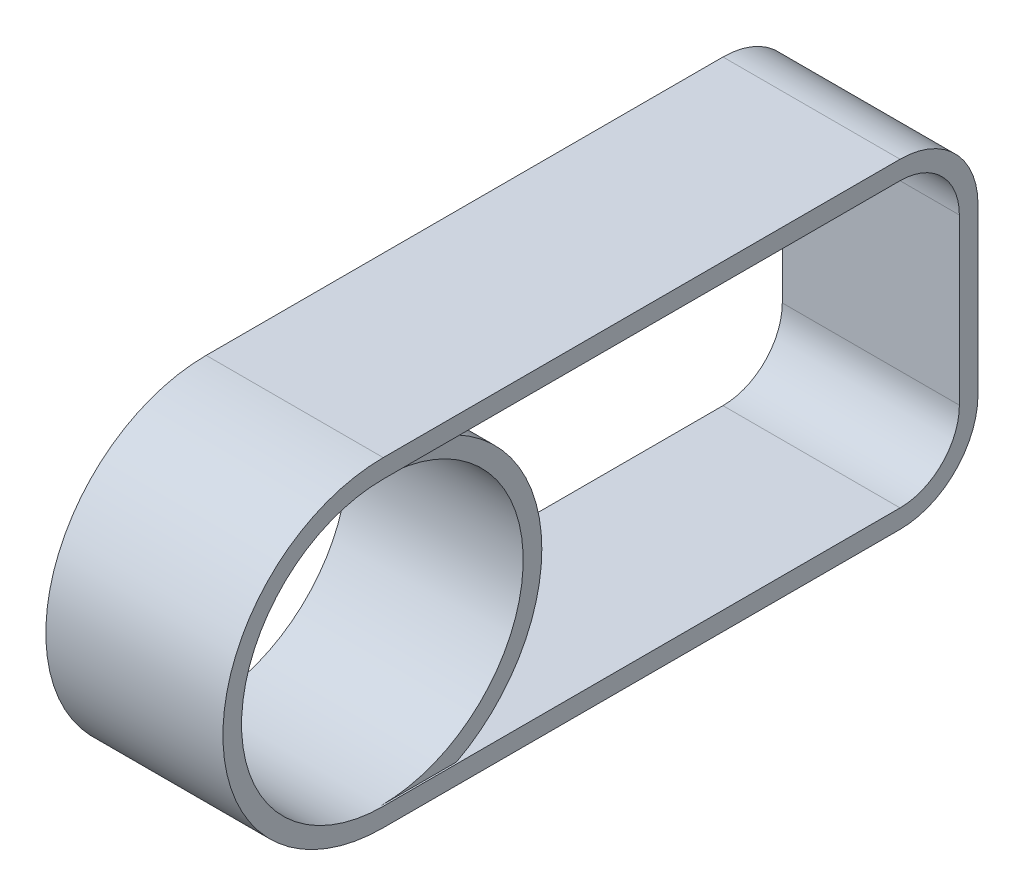
ISO-10303-21;
HEADER;
FILE_DESCRIPTION(('STEP AP214'),'2;1');
FILE_NAME('part.step','',(''),(''),'','','');
FILE_SCHEMA(('AUTOMOTIVE_DESIGN { 1 0 10303 214 1 1 1 1 }'));
ENDSEC;
DATA;
#1=APPLICATION_CONTEXT('core data for automotive mechanical design processes');
#2=APPLICATION_PROTOCOL_DEFINITION('international standard','automotive_design',2000,#1);
#3=PRODUCT_CONTEXT('',#1,'mechanical');
#4=PRODUCT('Part','Part','',(#3));
#5=PRODUCT_RELATED_PRODUCT_CATEGORY('part','',(#4));
#6=PRODUCT_DEFINITION_FORMATION('','',#4);
#7=PRODUCT_DEFINITION_CONTEXT('part definition',#1,'design');
#8=PRODUCT_DEFINITION('design','',#6,#7);
#9=PRODUCT_DEFINITION_SHAPE('','',#8);
#10=(LENGTH_UNIT() NAMED_UNIT(*) SI_UNIT(.MILLI.,.METRE.));
#11=(NAMED_UNIT(*) PLANE_ANGLE_UNIT() SI_UNIT($,.RADIAN.));
#12=(NAMED_UNIT(*) SI_UNIT($,.STERADIAN.) SOLID_ANGLE_UNIT());
#13=UNCERTAINTY_MEASURE_WITH_UNIT(LENGTH_MEASURE(1.E-05),#10,'distance_accuracy_value','');
#14=(GEOMETRIC_REPRESENTATION_CONTEXT(3) GLOBAL_UNCERTAINTY_ASSIGNED_CONTEXT((#13)) GLOBAL_UNIT_ASSIGNED_CONTEXT((#10,
#11,#12)) REPRESENTATION_CONTEXT('',''));
#15=CARTESIAN_POINT('',(0.,0.,0.));
#16=DIRECTION('',(0.,0.,1.));
#17=DIRECTION('',(1.,0.,0.));
#18=AXIS2_PLACEMENT_3D('',#15,#16,#17);
#19=CARTESIAN_POINT('',(1045.,836.,0.));
#20=DIRECTION('',(1.,0.,0.));
#21=DIRECTION('',(0.,0.,-1.));
#22=AXIS2_PLACEMENT_3D('',#19,#20,#21);
#23=PLANE('',#22);
#24=CARTESIAN_POINT('',(1045.,836.,0.));
#25=DIRECTION('',(1.,0.,0.));
#26=DIRECTION('',(0.,0.,-1.));
#27=AXIS2_PLACEMENT_3D('',#24,#25,#26);
#28=CIRCLE('',#27,836.);
#29=CARTESIAN_POINT('',(1045.,1672.,0.));
#30=VERTEX_POINT('',#29);
#31=CARTESIAN_POINT('',(1045.,0.,0.));
#32=VERTEX_POINT('',#31);
#33=EDGE_CURVE('E154',#30,#32,#28,.T.);
#34=ORIENTED_EDGE('',*,*,#33,.F.);
#35=DIRECTION('',(0.,0.,1.));
#36=VECTOR('',#35,1.);
#37=CARTESIAN_POINT('',(1045.,1672.,-3050.));
#38=LINE('',#37,#36);
#39=CARTESIAN_POINT('',(1045.,1672.,-3050.));
#40=VERTEX_POINT('',#39);
#41=EDGE_CURVE('E175',#40,#30,#38,.T.);
#42=ORIENTED_EDGE('',*,*,#41,.F.);
#43=CARTESIAN_POINT('',(1045.,1322.,-3050.));
#44=DIRECTION('',(1.,0.,0.));
#45=DIRECTION('',(0.,0.,-1.));
#46=AXIS2_PLACEMENT_3D('',#43,#44,#45);
#47=CIRCLE('',#46,350.);
#48=CARTESIAN_POINT('',(1045.,1322.,-3400.));
#49=VERTEX_POINT('',#48);
#50=EDGE_CURVE('E173',#49,#40,#47,.T.);
#51=ORIENTED_EDGE('',*,*,#50,.F.);
#52=DIRECTION('',(0.,1.,0.));
#53=VECTOR('',#52,1.);
#54=CARTESIAN_POINT('',(1045.,350.,-3400.));
#55=LINE('',#54,#53);
#56=CARTESIAN_POINT('',(1045.,350.,-3400.));
#57=VERTEX_POINT('',#56);
#58=EDGE_CURVE('E171',#57,#49,#55,.T.);
#59=ORIENTED_EDGE('',*,*,#58,.F.);
#60=CARTESIAN_POINT('',(1045.,350.,-3050.));
#61=DIRECTION('',(1.,0.,0.));
#62=DIRECTION('',(0.,0.,-1.));
#63=AXIS2_PLACEMENT_3D('',#60,#61,#62);
#64=CIRCLE('',#63,350.);
#65=CARTESIAN_POINT('',(1045.,0.,-3050.));
#66=VERTEX_POINT('',#65);
#67=EDGE_CURVE('E168',#66,#57,#64,.T.);
#68=ORIENTED_EDGE('',*,*,#67,.F.);
#69=DIRECTION('',(0.,0.,-1.));
#70=VECTOR('',#69,1.);
#71=CARTESIAN_POINT('',(1045.,0.,-442.741459544958));
#72=LINE('',#71,#70);
#73=EDGE_CURVE('E166',#32,#66,#72,.T.);
#74=ORIENTED_EDGE('',*,*,#73,.F.);
#75=EDGE_LOOP('',(#34,#42,#51,#59,#68,#74));
#76=FACE_BOUND('',#75,.T.);
#77=CARTESIAN_POINT('',(1045.,836.,0.));
#78=DIRECTION('',(1.,0.,0.));
#79=DIRECTION('',(0.,0.,-1.));
#80=AXIS2_PLACEMENT_3D('',#77,#78,#79);
#81=CIRCLE('',#80,946.);
#82=CARTESIAN_POINT('',(1045.,1782.,0.));
#83=VERTEX_POINT('',#82);
#84=CARTESIAN_POINT('',(1045.,-110.,0.));
#85=VERTEX_POINT('',#84);
#86=EDGE_CURVE('E204',#83,#85,#81,.T.);
#87=ORIENTED_EDGE('',*,*,#86,.T.);
#88=DIRECTION('',(0.,0.,-1.));
#89=VECTOR('',#88,1.);
#90=CARTESIAN_POINT('',(1045.,-110.,0.));
#91=LINE('',#90,#89);
#92=CARTESIAN_POINT('',(1045.,-110.,-3050.));
#93=VERTEX_POINT('',#92);
#94=EDGE_CURVE('E207',#85,#93,#91,.T.);
#95=ORIENTED_EDGE('',*,*,#94,.T.);
#96=CARTESIAN_POINT('',(1045.,350.,-3050.));
#97=DIRECTION('',(1.,0.,0.));
#98=DIRECTION('',(0.,0.,-1.));
#99=AXIS2_PLACEMENT_3D('',#96,#97,#98);
#100=CIRCLE('',#99,460.);
#101=CARTESIAN_POINT('',(1045.,350.,-3510.));
#102=VERTEX_POINT('',#101);
#103=EDGE_CURVE('E210',#93,#102,#100,.T.);
#104=ORIENTED_EDGE('',*,*,#103,.T.);
#105=DIRECTION('',(0.,1.,0.));
#106=VECTOR('',#105,1.);
#107=CARTESIAN_POINT('',(1045.,350.,-3510.));
#108=LINE('',#107,#106);
#109=CARTESIAN_POINT('',(1045.,1322.,-3510.));
#110=VERTEX_POINT('',#109);
#111=EDGE_CURVE('E212',#102,#110,#108,.T.);
#112=ORIENTED_EDGE('',*,*,#111,.T.);
#113=CARTESIAN_POINT('',(1045.,1322.,-3050.));
#114=DIRECTION('',(1.,0.,0.));
#115=DIRECTION('',(0.,0.,-1.));
#116=AXIS2_PLACEMENT_3D('',#113,#114,#115);
#117=CIRCLE('',#116,460.);
#118=CARTESIAN_POINT('',(1045.,1782.,-3050.));
#119=VERTEX_POINT('',#118);
#120=EDGE_CURVE('E214',#110,#119,#117,.T.);
#121=ORIENTED_EDGE('',*,*,#120,.T.);
#122=DIRECTION('',(0.,0.,1.));
#123=VECTOR('',#122,1.);
#124=CARTESIAN_POINT('',(1045.,1782.,-3050.));
#125=LINE('',#124,#123);
#126=EDGE_CURVE('E216',#119,#83,#125,.T.);
#127=ORIENTED_EDGE('',*,*,#126,.T.);
#128=EDGE_LOOP('',(#87,#95,#104,#112,#121,#127));
#129=FACE_BOUND('',#128,.T.);
#130=ADVANCED_FACE('F36',(#76,#129),#23,.T.);
#131=CARTESIAN_POINT('',(0.,836.,0.));
#132=DIRECTION('',(1.,0.,0.));
#133=DIRECTION('',(0.,0.,-1.));
#134=AXIS2_PLACEMENT_3D('',#131,#132,#133);
#135=PLANE('',#134);
#136=CARTESIAN_POINT('',(0.,836.,0.));
#137=DIRECTION('',(1.,0.,0.));
#138=DIRECTION('',(0.,0.,-1.));
#139=AXIS2_PLACEMENT_3D('',#136,#137,#138);
#140=CIRCLE('',#139,946.);
#141=CARTESIAN_POINT('',(0.,1782.,0.));
#142=VERTEX_POINT('',#141);
#143=CARTESIAN_POINT('',(0.,-110.,0.));
#144=VERTEX_POINT('',#143);
#145=EDGE_CURVE('E203',#142,#144,#140,.T.);
#146=ORIENTED_EDGE('',*,*,#145,.F.);
#147=DIRECTION('',(0.,0.,1.));
#148=VECTOR('',#147,1.);
#149=CARTESIAN_POINT('',(0.,1782.,-3050.));
#150=LINE('',#149,#148);
#151=CARTESIAN_POINT('',(0.,1782.,-3050.));
#152=VERTEX_POINT('',#151);
#153=EDGE_CURVE('E208',#152,#142,#150,.T.);
#154=ORIENTED_EDGE('',*,*,#153,.F.);
#155=CARTESIAN_POINT('',(0.,1322.,-3050.));
#156=DIRECTION('',(1.,0.,0.));
#157=DIRECTION('',(0.,0.,-1.));
#158=AXIS2_PLACEMENT_3D('',#155,#156,#157);
#159=CIRCLE('',#158,460.);
#160=CARTESIAN_POINT('',(0.,1322.,-3510.));
#161=VERTEX_POINT('',#160);
#162=EDGE_CURVE('E227',#161,#152,#159,.T.);
#163=ORIENTED_EDGE('',*,*,#162,.F.);
#164=DIRECTION('',(0.,1.,0.));
#165=VECTOR('',#164,1.);
#166=CARTESIAN_POINT('',(0.,350.,-3510.));
#167=LINE('',#166,#165);
#168=CARTESIAN_POINT('',(0.,350.,-3510.));
#169=VERTEX_POINT('',#168);
#170=EDGE_CURVE('E225',#169,#161,#167,.T.);
#171=ORIENTED_EDGE('',*,*,#170,.F.);
#172=CARTESIAN_POINT('',(0.,350.,-3050.));
#173=DIRECTION('',(1.,0.,0.));
#174=DIRECTION('',(0.,0.,-1.));
#175=AXIS2_PLACEMENT_3D('',#172,#173,#174);
#176=CIRCLE('',#175,460.);
#177=CARTESIAN_POINT('',(0.,-110.,-3050.));
#178=VERTEX_POINT('',#177);
#179=EDGE_CURVE('E223',#178,#169,#176,.T.);
#180=ORIENTED_EDGE('',*,*,#179,.F.);
#181=DIRECTION('',(0.,0.,-1.));
#182=VECTOR('',#181,1.);
#183=CARTESIAN_POINT('',(0.,-110.,0.));
#184=LINE('',#183,#182);
#185=EDGE_CURVE('E221',#144,#178,#184,.T.);
#186=ORIENTED_EDGE('',*,*,#185,.F.);
#187=EDGE_LOOP('',(#146,#154,#163,#171,#180,#186));
#188=FACE_BOUND('',#187,.T.);
#189=CARTESIAN_POINT('',(0.,836.,0.));
#190=DIRECTION('',(-1.,0.,0.));
#191=DIRECTION('',(0.,0.,-1.));
#192=AXIS2_PLACEMENT_3D('',#189,#190,#191);
#193=CIRCLE('',#192,946.);
#194=CARTESIAN_POINT('',(0.,1672.,-442.741459544959));
#195=VERTEX_POINT('',#194);
#196=CARTESIAN_POINT('',(0.,0.,-442.741459544958));
#197=VERTEX_POINT('',#196);
#198=EDGE_CURVE('E163',#195,#197,#193,.T.);
#199=ORIENTED_EDGE('',*,*,#198,.T.);
#200=DIRECTION('',(0.,0.,-1.));
#201=VECTOR('',#200,1.);
#202=CARTESIAN_POINT('',(0.,0.,-442.741459544958));
#203=LINE('',#202,#201);
#204=CARTESIAN_POINT('',(0.,0.,-3050.));
#205=VERTEX_POINT('',#204);
#206=EDGE_CURVE('E180',#197,#205,#203,.T.);
#207=ORIENTED_EDGE('',*,*,#206,.T.);
#208=CARTESIAN_POINT('',(0.,350.,-3050.));
#209=DIRECTION('',(1.,0.,0.));
#210=DIRECTION('',(0.,0.,-1.));
#211=AXIS2_PLACEMENT_3D('',#208,#209,#210);
#212=CIRCLE('',#211,350.);
#213=CARTESIAN_POINT('',(0.,350.,-3400.));
#214=VERTEX_POINT('',#213);
#215=EDGE_CURVE('E183',#205,#214,#212,.T.);
#216=ORIENTED_EDGE('',*,*,#215,.T.);
#217=DIRECTION('',(0.,1.,0.));
#218=VECTOR('',#217,1.);
#219=CARTESIAN_POINT('',(0.,350.,-3400.));
#220=LINE('',#219,#218);
#221=CARTESIAN_POINT('',(0.,1322.,-3400.));
#222=VERTEX_POINT('',#221);
#223=EDGE_CURVE('E186',#214,#222,#220,.T.);
#224=ORIENTED_EDGE('',*,*,#223,.T.);
#225=CARTESIAN_POINT('',(0.,1322.,-3050.));
#226=DIRECTION('',(1.,0.,0.));
#227=DIRECTION('',(0.,0.,-1.));
#228=AXIS2_PLACEMENT_3D('',#225,#226,#227);
#229=CIRCLE('',#228,350.);
#230=CARTESIAN_POINT('',(0.,1672.,-3050.));
#231=VERTEX_POINT('',#230);
#232=EDGE_CURVE('E189',#222,#231,#229,.T.);
#233=ORIENTED_EDGE('',*,*,#232,.T.);
#234=DIRECTION('',(0.,0.,1.));
#235=VECTOR('',#234,1.);
#236=CARTESIAN_POINT('',(0.,1672.,-3050.));
#237=LINE('',#236,#235);
#238=EDGE_CURVE('E169',#231,#195,#237,.T.);
#239=ORIENTED_EDGE('',*,*,#238,.T.);
#240=EDGE_LOOP('',(#199,#207,#216,#224,#233,#239));
#241=FACE_BOUND('',#240,.T.);
#242=CARTESIAN_POINT('',(0.,836.,0.));
#243=DIRECTION('',(1.,0.,0.));
#244=DIRECTION('',(0.,0.,-1.));
#245=AXIS2_PLACEMENT_3D('',#242,#243,#244);
#246=CIRCLE('',#245,836.);
#247=CARTESIAN_POINT('',(0.,836.,-836.));
#248=VERTEX_POINT('',#247);
#249=EDGE_CURVE('E161',#248,#248,#246,.T.);
#250=ORIENTED_EDGE('',*,*,#249,.T.);
#251=EDGE_LOOP('',(#250));
#252=FACE_BOUND('',#251,.T.);
#253=ADVANCED_FACE('F254',(#188,#241,#252),#135,.F.);
#254=CARTESIAN_POINT('',(1045.,836.,0.));
#255=DIRECTION('',(-1.,0.,0.));
#256=DIRECTION('',(0.,0.,1.));
#257=AXIS2_PLACEMENT_3D('',#254,#255,#256);
#258=CYLINDRICAL_SURFACE('',#257,946.);
#259=ORIENTED_EDGE('',*,*,#145,.T.);
#260=DIRECTION('',(-1.,0.,0.));
#261=VECTOR('',#260,1.);
#262=CARTESIAN_POINT('',(1045.,-110.,0.));
#263=LINE('',#262,#261);
#264=EDGE_CURVE('E44',#85,#144,#263,.T.);
#265=ORIENTED_EDGE('',*,*,#264,.F.);
#266=ORIENTED_EDGE('',*,*,#86,.F.);
#267=DIRECTION('',(-1.,0.,0.));
#268=VECTOR('',#267,1.);
#269=CARTESIAN_POINT('',(1045.,1782.,0.));
#270=LINE('',#269,#268);
#271=EDGE_CURVE('E218',#83,#142,#270,.T.);
#272=ORIENTED_EDGE('',*,*,#271,.T.);
#273=EDGE_LOOP('',(#259,#265,#266,#272));
#274=FACE_BOUND('',#273,.T.);
#275=ADVANCED_FACE('F38',(#274),#258,.T.);
#276=CARTESIAN_POINT('',(1045.,-110.,0.));
#277=DIRECTION('',(0.,1.,0.));
#278=DIRECTION('',(0.,0.,1.));
#279=AXIS2_PLACEMENT_3D('',#276,#277,#278);
#280=PLANE('',#279);
#281=ORIENTED_EDGE('',*,*,#185,.T.);
#282=DIRECTION('',(-1.,0.,0.));
#283=VECTOR('',#282,1.);
#284=CARTESIAN_POINT('',(1045.,-110.,-3050.));
#285=LINE('',#284,#283);
#286=EDGE_CURVE('E241',#93,#178,#285,.T.);
#287=ORIENTED_EDGE('',*,*,#286,.F.);
#288=ORIENTED_EDGE('',*,*,#94,.F.);
#289=ORIENTED_EDGE('',*,*,#264,.T.);
#290=EDGE_LOOP('',(#281,#287,#288,#289));
#291=FACE_BOUND('',#290,.T.);
#292=ADVANCED_FACE('F246',(#291),#280,.F.);
#293=CARTESIAN_POINT('',(1045.,350.,-3050.));
#294=DIRECTION('',(-1.,0.,0.));
#295=DIRECTION('',(0.,0.,1.));
#296=AXIS2_PLACEMENT_3D('',#293,#294,#295);
#297=CYLINDRICAL_SURFACE('',#296,460.);
#298=ORIENTED_EDGE('',*,*,#179,.T.);
#299=DIRECTION('',(-1.,0.,0.));
#300=VECTOR('',#299,1.);
#301=CARTESIAN_POINT('',(1045.,350.,-3510.));
#302=LINE('',#301,#300);
#303=EDGE_CURVE('E238',#102,#169,#302,.T.);
#304=ORIENTED_EDGE('',*,*,#303,.F.);
#305=ORIENTED_EDGE('',*,*,#103,.F.);
#306=ORIENTED_EDGE('',*,*,#286,.T.);
#307=EDGE_LOOP('',(#298,#304,#305,#306));
#308=FACE_BOUND('',#307,.T.);
#309=ADVANCED_FACE('F261',(#308),#297,.T.);
#310=CARTESIAN_POINT('',(1045.,350.,-3510.));
#311=DIRECTION('',(0.,0.,1.));
#312=DIRECTION('',(1.,0.,0.));
#313=AXIS2_PLACEMENT_3D('',#310,#311,#312);
#314=PLANE('',#313);
#315=ORIENTED_EDGE('',*,*,#170,.T.);
#316=DIRECTION('',(-1.,0.,0.));
#317=VECTOR('',#316,1.);
#318=CARTESIAN_POINT('',(1045.,1322.,-3510.));
#319=LINE('',#318,#317);
#320=EDGE_CURVE('E235',#110,#161,#319,.T.);
#321=ORIENTED_EDGE('',*,*,#320,.F.);
#322=ORIENTED_EDGE('',*,*,#111,.F.);
#323=ORIENTED_EDGE('',*,*,#303,.T.);
#324=EDGE_LOOP('',(#315,#321,#322,#323));
#325=FACE_BOUND('',#324,.T.);
#326=ADVANCED_FACE('F265',(#325),#314,.F.);
#327=CARTESIAN_POINT('',(1045.,1322.,-3050.));
#328=DIRECTION('',(-1.,0.,0.));
#329=DIRECTION('',(0.,0.,1.));
#330=AXIS2_PLACEMENT_3D('',#327,#328,#329);
#331=CYLINDRICAL_SURFACE('',#330,460.);
#332=ORIENTED_EDGE('',*,*,#162,.T.);
#333=DIRECTION('',(-1.,0.,0.));
#334=VECTOR('',#333,1.);
#335=CARTESIAN_POINT('',(1045.,1782.,-3050.));
#336=LINE('',#335,#334);
#337=EDGE_CURVE('E232',#119,#152,#336,.T.);
#338=ORIENTED_EDGE('',*,*,#337,.F.);
#339=ORIENTED_EDGE('',*,*,#120,.F.);
#340=ORIENTED_EDGE('',*,*,#320,.T.);
#341=EDGE_LOOP('',(#332,#338,#339,#340));
#342=FACE_BOUND('',#341,.T.);
#343=ADVANCED_FACE('F274',(#342),#331,.T.);
#344=CARTESIAN_POINT('',(1045.,1782.,-3050.));
#345=DIRECTION('',(0.,-1.,0.));
#346=DIRECTION('',(0.,0.,-1.));
#347=AXIS2_PLACEMENT_3D('',#344,#345,#346);
#348=PLANE('',#347);
#349=ORIENTED_EDGE('',*,*,#153,.T.);
#350=ORIENTED_EDGE('',*,*,#271,.F.);
#351=ORIENTED_EDGE('',*,*,#126,.F.);
#352=ORIENTED_EDGE('',*,*,#337,.T.);
#353=EDGE_LOOP('',(#349,#350,#351,#352));
#354=FACE_BOUND('',#353,.T.);
#355=ADVANCED_FACE('F272',(#354),#348,.F.);
#356=CARTESIAN_POINT('',(1045.,836.,0.));
#357=DIRECTION('',(-1.,0.,0.));
#358=DIRECTION('',(0.,0.,1.));
#359=AXIS2_PLACEMENT_3D('',#356,#357,#358);
#360=CYLINDRICAL_SURFACE('',#359,946.);
#361=CARTESIAN_POINT('',(1035.,836.,0.));
#362=DIRECTION('',(-1.,0.,0.));
#363=DIRECTION('',(0.,0.,1.));
#364=AXIS2_PLACEMENT_3D('',#361,#362,#363);
#365=CIRCLE('',#364,946.);
#366=CARTESIAN_POINT('',(1035.,0.,-442.741459544958));
#367=VERTEX_POINT('',#366);
#368=CARTESIAN_POINT('',(1035.,1672.,-442.741459544959));
#369=VERTEX_POINT('',#368);
#370=EDGE_CURVE('E156',#367,#369,#365,.F.);
#371=ORIENTED_EDGE('',*,*,#370,.F.);
#372=DIRECTION('',(-1.,0.,0.));
#373=VECTOR('',#372,1.);
#374=CARTESIAN_POINT('',(1045.,0.,-442.741459544958));
#375=LINE('',#374,#373);
#376=EDGE_CURVE('E149',#367,#197,#375,.T.);
#377=ORIENTED_EDGE('',*,*,#376,.T.);
#378=ORIENTED_EDGE('',*,*,#198,.F.);
#379=DIRECTION('',(-1.,0.,0.));
#380=VECTOR('',#379,1.);
#381=CARTESIAN_POINT('',(1045.,1672.,-442.741459544959));
#382=LINE('',#381,#380);
#383=EDGE_CURVE('E177',#369,#195,#382,.T.);
#384=ORIENTED_EDGE('',*,*,#383,.F.);
#385=EDGE_LOOP('',(#371,#377,#378,#384));
#386=FACE_BOUND('',#385,.T.);
#387=ADVANCED_FACE('F281',(#386),#360,.T.);
#388=CARTESIAN_POINT('',(1045.,0.,-442.741459544958));
#389=DIRECTION('',(0.,1.,0.));
#390=DIRECTION('',(0.,0.,1.));
#391=AXIS2_PLACEMENT_3D('',#388,#389,#390);
#392=PLANE('',#391);
#393=ORIENTED_EDGE('',*,*,#73,.T.);
#394=DIRECTION('',(-1.,0.,0.));
#395=VECTOR('',#394,1.);
#396=CARTESIAN_POINT('',(1045.,0.,-3050.));
#397=LINE('',#396,#395);
#398=EDGE_CURVE('E200',#66,#205,#397,.T.);
#399=ORIENTED_EDGE('',*,*,#398,.T.);
#400=ORIENTED_EDGE('',*,*,#206,.F.);
#401=ORIENTED_EDGE('',*,*,#376,.F.);
#402=DIRECTION('',(0.,0.,-1.));
#403=VECTOR('',#402,1.);
#404=CARTESIAN_POINT('',(1035.,0.,-1071.49392456679));
#405=LINE('',#404,#403);
#406=CARTESIAN_POINT('',(1035.,0.,0.));
#407=VERTEX_POINT('',#406);
#408=EDGE_CURVE('E137',#407,#367,#405,.T.);
#409=ORIENTED_EDGE('',*,*,#408,.F.);
#410=DIRECTION('',(1.,0.,0.));
#411=VECTOR('',#410,1.);
#412=CARTESIAN_POINT('',(1035.,0.,0.));
#413=LINE('',#412,#411);
#414=EDGE_CURVE('E146',#407,#32,#413,.T.);
#415=ORIENTED_EDGE('',*,*,#414,.T.);
#416=EDGE_LOOP('',(#393,#399,#400,#401,#409,#415));
#417=FACE_BOUND('',#416,.T.);
#418=ADVANCED_FACE('F145',(#417),#392,.T.);
#419=CARTESIAN_POINT('',(1045.,350.,-3050.));
#420=DIRECTION('',(-1.,0.,0.));
#421=DIRECTION('',(0.,0.,1.));
#422=AXIS2_PLACEMENT_3D('',#419,#420,#421);
#423=CYLINDRICAL_SURFACE('',#422,350.);
#424=ORIENTED_EDGE('',*,*,#215,.F.);
#425=ORIENTED_EDGE('',*,*,#398,.F.);
#426=ORIENTED_EDGE('',*,*,#67,.T.);
#427=DIRECTION('',(-1.,0.,0.));
#428=VECTOR('',#427,1.);
#429=CARTESIAN_POINT('',(1045.,350.,-3400.));
#430=LINE('',#429,#428);
#431=EDGE_CURVE('E198',#57,#214,#430,.T.);
#432=ORIENTED_EDGE('',*,*,#431,.T.);
#433=EDGE_LOOP('',(#424,#425,#426,#432));
#434=FACE_BOUND('',#433,.T.);
#435=ADVANCED_FACE('F297',(#434),#423,.F.);
#436=CARTESIAN_POINT('',(1045.,350.,-3400.));
#437=DIRECTION('',(0.,0.,1.));
#438=DIRECTION('',(1.,0.,0.));
#439=AXIS2_PLACEMENT_3D('',#436,#437,#438);
#440=PLANE('',#439);
#441=ORIENTED_EDGE('',*,*,#223,.F.);
#442=ORIENTED_EDGE('',*,*,#431,.F.);
#443=ORIENTED_EDGE('',*,*,#58,.T.);
#444=DIRECTION('',(-1.,0.,0.));
#445=VECTOR('',#444,1.);
#446=CARTESIAN_POINT('',(1045.,1322.,-3400.));
#447=LINE('',#446,#445);
#448=EDGE_CURVE('E196',#49,#222,#447,.T.);
#449=ORIENTED_EDGE('',*,*,#448,.T.);
#450=EDGE_LOOP('',(#441,#442,#443,#449));
#451=FACE_BOUND('',#450,.T.);
#452=ADVANCED_FACE('F300',(#451),#440,.T.);
#453=CARTESIAN_POINT('',(1045.,1322.,-3050.));
#454=DIRECTION('',(-1.,0.,0.));
#455=DIRECTION('',(0.,0.,1.));
#456=AXIS2_PLACEMENT_3D('',#453,#454,#455);
#457=CYLINDRICAL_SURFACE('',#456,350.);
#458=ORIENTED_EDGE('',*,*,#232,.F.);
#459=ORIENTED_EDGE('',*,*,#448,.F.);
#460=ORIENTED_EDGE('',*,*,#50,.T.);
#461=DIRECTION('',(-1.,0.,0.));
#462=VECTOR('',#461,1.);
#463=CARTESIAN_POINT('',(1045.,1672.,-3050.));
#464=LINE('',#463,#462);
#465=EDGE_CURVE('E57',#40,#231,#464,.T.);
#466=ORIENTED_EDGE('',*,*,#465,.T.);
#467=EDGE_LOOP('',(#458,#459,#460,#466));
#468=FACE_BOUND('',#467,.T.);
#469=ADVANCED_FACE('F304',(#468),#457,.F.);
#470=CARTESIAN_POINT('',(1045.,1672.,-3050.));
#471=DIRECTION('',(0.,-1.,0.));
#472=DIRECTION('',(0.,0.,-1.));
#473=AXIS2_PLACEMENT_3D('',#470,#471,#472);
#474=PLANE('',#473);
#475=ORIENTED_EDGE('',*,*,#41,.T.);
#476=DIRECTION('',(1.,0.,0.));
#477=VECTOR('',#476,1.);
#478=CARTESIAN_POINT('',(1035.,1672.,0.));
#479=LINE('',#478,#477);
#480=CARTESIAN_POINT('',(1035.,1672.,0.));
#481=VERTEX_POINT('',#480);
#482=EDGE_CURVE('E51',#481,#30,#479,.T.);
#483=ORIENTED_EDGE('',*,*,#482,.F.);
#484=DIRECTION('',(0.,0.,1.));
#485=VECTOR('',#484,1.);
#486=CARTESIAN_POINT('',(1035.,1672.,0.));
#487=LINE('',#486,#485);
#488=EDGE_CURVE('E139',#369,#481,#487,.T.);
#489=ORIENTED_EDGE('',*,*,#488,.F.);
#490=ORIENTED_EDGE('',*,*,#383,.T.);
#491=ORIENTED_EDGE('',*,*,#238,.F.);
#492=ORIENTED_EDGE('',*,*,#465,.F.);
#493=EDGE_LOOP('',(#475,#483,#489,#490,#491,#492));
#494=FACE_BOUND('',#493,.T.);
#495=ADVANCED_FACE('F308',(#494),#474,.T.);
#496=CARTESIAN_POINT('',(1045.,836.,0.));
#497=DIRECTION('',(-1.,0.,0.));
#498=DIRECTION('',(0.,0.,1.));
#499=AXIS2_PLACEMENT_3D('',#496,#497,#498);
#500=CYLINDRICAL_SURFACE('',#499,836.);
#501=ORIENTED_EDGE('',*,*,#482,.T.);
#502=ORIENTED_EDGE('',*,*,#33,.T.);
#503=ORIENTED_EDGE('',*,*,#414,.F.);
#504=CARTESIAN_POINT('',(1035.,836.,0.));
#505=DIRECTION('',(-1.,0.,0.));
#506=DIRECTION('',(0.,0.,1.));
#507=AXIS2_PLACEMENT_3D('',#504,#505,#506);
#508=CIRCLE('',#507,836.);
#509=EDGE_CURVE('E11',#481,#407,#508,.T.);
#510=ORIENTED_EDGE('',*,*,#509,.F.);
#511=EDGE_LOOP('',(#501,#502,#503,#510));
#512=FACE_BOUND('',#511,.T.);
#513=ORIENTED_EDGE('',*,*,#249,.F.);
#514=EDGE_LOOP('',(#513));
#515=FACE_BOUND('',#514,.T.);
#516=ADVANCED_FACE('F151',(#512,#515),#500,.F.);
#517=CARTESIAN_POINT('',(1035.,0.,0.));
#518=DIRECTION('',(-1.,0.,0.));
#519=DIRECTION('',(0.,0.,1.));
#520=AXIS2_PLACEMENT_3D('',#517,#518,#519);
#521=PLANE('',#520);
#522=ORIENTED_EDGE('',*,*,#370,.T.);
#523=ORIENTED_EDGE('',*,*,#488,.T.);
#524=ORIENTED_EDGE('',*,*,#509,.T.);
#525=ORIENTED_EDGE('',*,*,#408,.T.);
#526=EDGE_LOOP('',(#522,#523,#524,#525));
#527=FACE_BOUND('',#526,.T.);
#528=ADVANCED_FACE('F136',(#527),#521,.F.);
#529=CLOSED_SHELL('',(#130,#253,#275,#292,#309,#326,#343,#355,#387,#418,#435,#452,#469,#495,
#516,#528));
#530=MANIFOLD_SOLID_BREP('B2',#529);
#531=ADVANCED_BREP_SHAPE_REPRESENTATION('',(#18,#530),#14);
#532=SHAPE_DEFINITION_REPRESENTATION(#9,#531);
ENDSEC;
END-ISO-10303-21;
